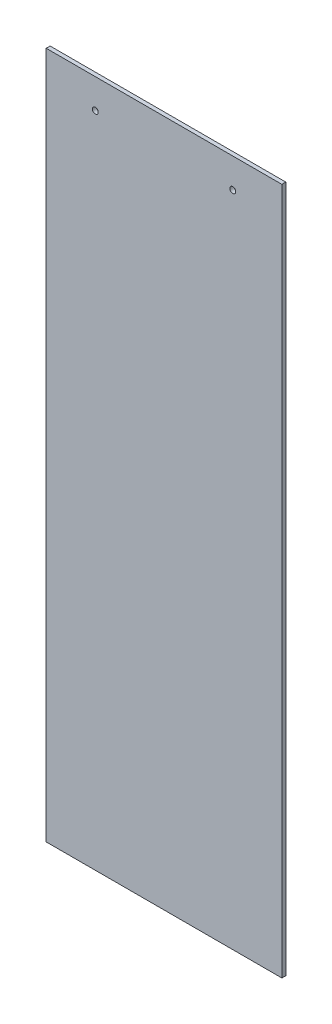
ISO-10303-21;
HEADER;
FILE_DESCRIPTION(('STEP AP214'),'2;1');
FILE_NAME('part.step','',(''),(''),'','','');
FILE_SCHEMA(('AUTOMOTIVE_DESIGN { 1 0 10303 214 1 1 1 1 }'));
ENDSEC;
DATA;
#1=APPLICATION_CONTEXT('core data for automotive mechanical design processes');
#2=APPLICATION_PROTOCOL_DEFINITION('international standard','automotive_design',2000,#1);
#3=PRODUCT_CONTEXT('',#1,'mechanical');
#4=PRODUCT('Part','Part','',(#3));
#5=PRODUCT_RELATED_PRODUCT_CATEGORY('part','',(#4));
#6=PRODUCT_DEFINITION_FORMATION('','',#4);
#7=PRODUCT_DEFINITION_CONTEXT('part definition',#1,'design');
#8=PRODUCT_DEFINITION('design','',#6,#7);
#9=PRODUCT_DEFINITION_SHAPE('','',#8);
#10=(LENGTH_UNIT() NAMED_UNIT(*) SI_UNIT(.MILLI.,.METRE.));
#11=(NAMED_UNIT(*) PLANE_ANGLE_UNIT() SI_UNIT($,.RADIAN.));
#12=(NAMED_UNIT(*) SI_UNIT($,.STERADIAN.) SOLID_ANGLE_UNIT());
#13=UNCERTAINTY_MEASURE_WITH_UNIT(LENGTH_MEASURE(1.E-05),#10,'distance_accuracy_value','');
#14=(GEOMETRIC_REPRESENTATION_CONTEXT(3) GLOBAL_UNCERTAINTY_ASSIGNED_CONTEXT((#13)) GLOBAL_UNIT_ASSIGNED_CONTEXT((#10,
#11,#12)) REPRESENTATION_CONTEXT('',''));
#15=CARTESIAN_POINT('',(0.,0.,0.));
#16=DIRECTION('',(0.,0.,1.));
#17=DIRECTION('',(1.,0.,0.));
#18=AXIS2_PLACEMENT_3D('',#15,#16,#17);
#19=CARTESIAN_POINT('',(-60.,175.,0.));
#20=DIRECTION('',(-1.,0.,0.));
#21=DIRECTION('',(0.,0.,1.));
#22=AXIS2_PLACEMENT_3D('',#19,#20,#21);
#23=PLANE('',#22);
#24=DIRECTION('',(0.,-1.,0.));
#25=VECTOR('',#24,1.);
#26=CARTESIAN_POINT('',(-60.,175.,2.));
#27=LINE('',#26,#25);
#28=CARTESIAN_POINT('',(-60.,175.,2.));
#29=VERTEX_POINT('',#28);
#30=CARTESIAN_POINT('',(-60.,-175.,2.));
#31=VERTEX_POINT('',#30);
#32=EDGE_CURVE('E98',#29,#31,#27,.T.);
#33=ORIENTED_EDGE('',*,*,#32,.F.);
#34=DIRECTION('',(0.,0.,1.));
#35=VECTOR('',#34,1.);
#36=CARTESIAN_POINT('',(-60.,175.,0.));
#37=LINE('',#36,#35);
#38=CARTESIAN_POINT('',(-60.,175.,0.));
#39=VERTEX_POINT('',#38);
#40=EDGE_CURVE('E11',#39,#29,#37,.T.);
#41=ORIENTED_EDGE('',*,*,#40,.F.);
#42=DIRECTION('',(0.,-1.,0.));
#43=VECTOR('',#42,1.);
#44=CARTESIAN_POINT('',(-60.,175.,0.));
#45=LINE('',#44,#43);
#46=CARTESIAN_POINT('',(-60.,-175.,0.));
#47=VERTEX_POINT('',#46);
#48=EDGE_CURVE('E91',#39,#47,#45,.T.);
#49=ORIENTED_EDGE('',*,*,#48,.T.);
#50=DIRECTION('',(0.,0.,1.));
#51=VECTOR('',#50,1.);
#52=CARTESIAN_POINT('',(-60.,-175.,0.));
#53=LINE('',#52,#51);
#54=EDGE_CURVE('E36',#47,#31,#53,.T.);
#55=ORIENTED_EDGE('',*,*,#54,.T.);
#56=EDGE_LOOP('',(#33,#41,#49,#55));
#57=FACE_BOUND('',#56,.T.);
#58=ADVANCED_FACE('F33',(#57),#23,.T.);
#59=CARTESIAN_POINT('',(60.,175.,0.));
#60=DIRECTION('',(0.,1.,0.));
#61=DIRECTION('',(0.,0.,1.));
#62=AXIS2_PLACEMENT_3D('',#59,#60,#61);
#63=PLANE('',#62);
#64=DIRECTION('',(-1.,0.,0.));
#65=VECTOR('',#64,1.);
#66=CARTESIAN_POINT('',(60.,175.,2.));
#67=LINE('',#66,#65);
#68=CARTESIAN_POINT('',(60.,175.,2.));
#69=VERTEX_POINT('',#68);
#70=EDGE_CURVE('E93',#69,#29,#67,.T.);
#71=ORIENTED_EDGE('',*,*,#70,.F.);
#72=DIRECTION('',(0.,0.,1.));
#73=VECTOR('',#72,1.);
#74=CARTESIAN_POINT('',(60.,175.,0.));
#75=LINE('',#74,#73);
#76=CARTESIAN_POINT('',(60.,175.,0.));
#77=VERTEX_POINT('',#76);
#78=EDGE_CURVE('E42',#77,#69,#75,.T.);
#79=ORIENTED_EDGE('',*,*,#78,.F.);
#80=DIRECTION('',(-1.,0.,0.));
#81=VECTOR('',#80,1.);
#82=CARTESIAN_POINT('',(60.,175.,0.));
#83=LINE('',#82,#81);
#84=EDGE_CURVE('E88',#77,#39,#83,.T.);
#85=ORIENTED_EDGE('',*,*,#84,.T.);
#86=ORIENTED_EDGE('',*,*,#40,.T.);
#87=EDGE_LOOP('',(#71,#79,#85,#86));
#88=FACE_BOUND('',#87,.T.);
#89=ADVANCED_FACE('F109',(#88),#63,.T.);
#90=CARTESIAN_POINT('',(60.,-175.,0.));
#91=DIRECTION('',(1.,0.,0.));
#92=DIRECTION('',(0.,0.,-1.));
#93=AXIS2_PLACEMENT_3D('',#90,#91,#92);
#94=PLANE('',#93);
#95=DIRECTION('',(0.,1.,0.));
#96=VECTOR('',#95,1.);
#97=CARTESIAN_POINT('',(60.,-175.,2.));
#98=LINE('',#97,#96);
#99=CARTESIAN_POINT('',(60.,-175.,2.));
#100=VERTEX_POINT('',#99);
#101=EDGE_CURVE('E83',#100,#69,#98,.T.);
#102=ORIENTED_EDGE('',*,*,#101,.F.);
#103=DIRECTION('',(0.,0.,1.));
#104=VECTOR('',#103,1.);
#105=CARTESIAN_POINT('',(60.,-175.,0.));
#106=LINE('',#105,#104);
#107=CARTESIAN_POINT('',(60.,-175.,0.));
#108=VERTEX_POINT('',#107);
#109=EDGE_CURVE('E78',#108,#100,#106,.T.);
#110=ORIENTED_EDGE('',*,*,#109,.F.);
#111=DIRECTION('',(0.,1.,0.));
#112=VECTOR('',#111,1.);
#113=CARTESIAN_POINT('',(60.,-175.,0.));
#114=LINE('',#113,#112);
#115=EDGE_CURVE('E81',#108,#77,#114,.T.);
#116=ORIENTED_EDGE('',*,*,#115,.T.);
#117=ORIENTED_EDGE('',*,*,#78,.T.);
#118=EDGE_LOOP('',(#102,#110,#116,#117));
#119=FACE_BOUND('',#118,.T.);
#120=ADVANCED_FACE('F80',(#119),#94,.T.);
#121=CARTESIAN_POINT('',(-60.,-175.,0.));
#122=DIRECTION('',(0.,-1.,0.));
#123=DIRECTION('',(0.,0.,-1.));
#124=AXIS2_PLACEMENT_3D('',#121,#122,#123);
#125=PLANE('',#124);
#126=DIRECTION('',(1.,0.,0.));
#127=VECTOR('',#126,1.);
#128=CARTESIAN_POINT('',(-60.,-175.,2.));
#129=LINE('',#128,#127);
#130=EDGE_CURVE('E101',#31,#100,#129,.T.);
#131=ORIENTED_EDGE('',*,*,#130,.F.);
#132=ORIENTED_EDGE('',*,*,#54,.F.);
#133=DIRECTION('',(1.,0.,0.));
#134=VECTOR('',#133,1.);
#135=CARTESIAN_POINT('',(-60.,-175.,0.));
#136=LINE('',#135,#134);
#137=EDGE_CURVE('E87',#47,#108,#136,.T.);
#138=ORIENTED_EDGE('',*,*,#137,.T.);
#139=ORIENTED_EDGE('',*,*,#109,.T.);
#140=EDGE_LOOP('',(#131,#132,#138,#139));
#141=FACE_BOUND('',#140,.T.);
#142=ADVANCED_FACE('F90',(#141),#125,.T.);
#143=CARTESIAN_POINT('',(0.,0.,0.));
#144=DIRECTION('',(0.,0.,1.));
#145=DIRECTION('',(1.,0.,0.));
#146=AXIS2_PLACEMENT_3D('',#143,#144,#145);
#147=PLANE('',#146);
#148=CARTESIAN_POINT('',(-35.,160.,0.));
#149=DIRECTION('',(0.,0.,1.));
#150=DIRECTION('',(-1.,0.,0.));
#151=AXIS2_PLACEMENT_3D('',#148,#149,#150);
#152=CIRCLE('',#151,1.5);
#153=CARTESIAN_POINT('',(-36.5,160.,0.));
#154=VERTEX_POINT('',#153);
#155=EDGE_CURVE('E142',#154,#154,#152,.T.);
#156=ORIENTED_EDGE('',*,*,#155,.T.);
#157=EDGE_LOOP('',(#156));
#158=FACE_BOUND('',#157,.T.);
#159=CARTESIAN_POINT('',(35.,160.,0.));
#160=DIRECTION('',(0.,0.,1.));
#161=DIRECTION('',(-1.,0.,0.));
#162=AXIS2_PLACEMENT_3D('',#159,#160,#161);
#163=CIRCLE('',#162,1.5);
#164=CARTESIAN_POINT('',(33.5,160.,0.));
#165=VERTEX_POINT('',#164);
#166=EDGE_CURVE('E102',#165,#165,#163,.T.);
#167=ORIENTED_EDGE('',*,*,#166,.T.);
#168=EDGE_LOOP('',(#167));
#169=FACE_BOUND('',#168,.T.);
#170=ORIENTED_EDGE('',*,*,#48,.F.);
#171=ORIENTED_EDGE('',*,*,#84,.F.);
#172=ORIENTED_EDGE('',*,*,#115,.F.);
#173=ORIENTED_EDGE('',*,*,#137,.F.);
#174=EDGE_LOOP('',(#170,#171,#172,#173));
#175=FACE_BOUND('',#174,.T.);
#176=ADVANCED_FACE('F86',(#158,#169,#175),#147,.F.);
#177=CARTESIAN_POINT('',(0.,0.,2.));
#178=DIRECTION('',(0.,0.,1.));
#179=DIRECTION('',(1.,0.,0.));
#180=AXIS2_PLACEMENT_3D('',#177,#178,#179);
#181=PLANE('',#180);
#182=CARTESIAN_POINT('',(-35.,160.,2.));
#183=DIRECTION('',(0.,0.,1.));
#184=DIRECTION('',(-1.,0.,0.));
#185=AXIS2_PLACEMENT_3D('',#182,#183,#184);
#186=CIRCLE('',#185,1.5);
#187=CARTESIAN_POINT('',(-36.5,160.,2.));
#188=VERTEX_POINT('',#187);
#189=EDGE_CURVE('E145',#188,#188,#186,.T.);
#190=ORIENTED_EDGE('',*,*,#189,.F.);
#191=EDGE_LOOP('',(#190));
#192=FACE_BOUND('',#191,.T.);
#193=CARTESIAN_POINT('',(35.,160.,2.));
#194=DIRECTION('',(0.,0.,1.));
#195=DIRECTION('',(-1.,0.,0.));
#196=AXIS2_PLACEMENT_3D('',#193,#194,#195);
#197=CIRCLE('',#196,1.5);
#198=CARTESIAN_POINT('',(33.5,160.,2.));
#199=VERTEX_POINT('',#198);
#200=EDGE_CURVE('E147',#199,#199,#197,.T.);
#201=ORIENTED_EDGE('',*,*,#200,.F.);
#202=EDGE_LOOP('',(#201));
#203=FACE_BOUND('',#202,.T.);
#204=ORIENTED_EDGE('',*,*,#32,.T.);
#205=ORIENTED_EDGE('',*,*,#130,.T.);
#206=ORIENTED_EDGE('',*,*,#101,.T.);
#207=ORIENTED_EDGE('',*,*,#70,.T.);
#208=EDGE_LOOP('',(#204,#205,#206,#207));
#209=FACE_BOUND('',#208,.T.);
#210=ADVANCED_FACE('F108',(#192,#203,#209),#181,.T.);
#211=CARTESIAN_POINT('',(35.,160.,0.));
#212=DIRECTION('',(0.,0.,1.));
#213=DIRECTION('',(1.,0.,0.));
#214=AXIS2_PLACEMENT_3D('',#211,#212,#213);
#215=CYLINDRICAL_SURFACE('',#214,1.5);
#216=ORIENTED_EDGE('',*,*,#166,.F.);
#217=EDGE_LOOP('',(#216));
#218=FACE_BOUND('',#217,.T.);
#219=ORIENTED_EDGE('',*,*,#200,.T.);
#220=EDGE_LOOP('',(#219));
#221=FACE_BOUND('',#220,.T.);
#222=ADVANCED_FACE('F127',(#218,#221),#215,.F.);
#223=CARTESIAN_POINT('',(-35.,160.,0.));
#224=DIRECTION('',(0.,0.,1.));
#225=DIRECTION('',(1.,0.,0.));
#226=AXIS2_PLACEMENT_3D('',#223,#224,#225);
#227=CYLINDRICAL_SURFACE('',#226,1.5);
#228=ORIENTED_EDGE('',*,*,#155,.F.);
#229=EDGE_LOOP('',(#228));
#230=FACE_BOUND('',#229,.T.);
#231=ORIENTED_EDGE('',*,*,#189,.T.);
#232=EDGE_LOOP('',(#231));
#233=FACE_BOUND('',#232,.T.);
#234=ADVANCED_FACE('F134',(#230,#233),#227,.F.);
#235=CLOSED_SHELL('',(#58,#89,#120,#142,#176,#210,#222,#234));
#236=MANIFOLD_SOLID_BREP('B2',#235);
#237=ADVANCED_BREP_SHAPE_REPRESENTATION('',(#18,#236),#14);
#238=SHAPE_DEFINITION_REPRESENTATION(#9,#237);
ENDSEC;
END-ISO-10303-21;
